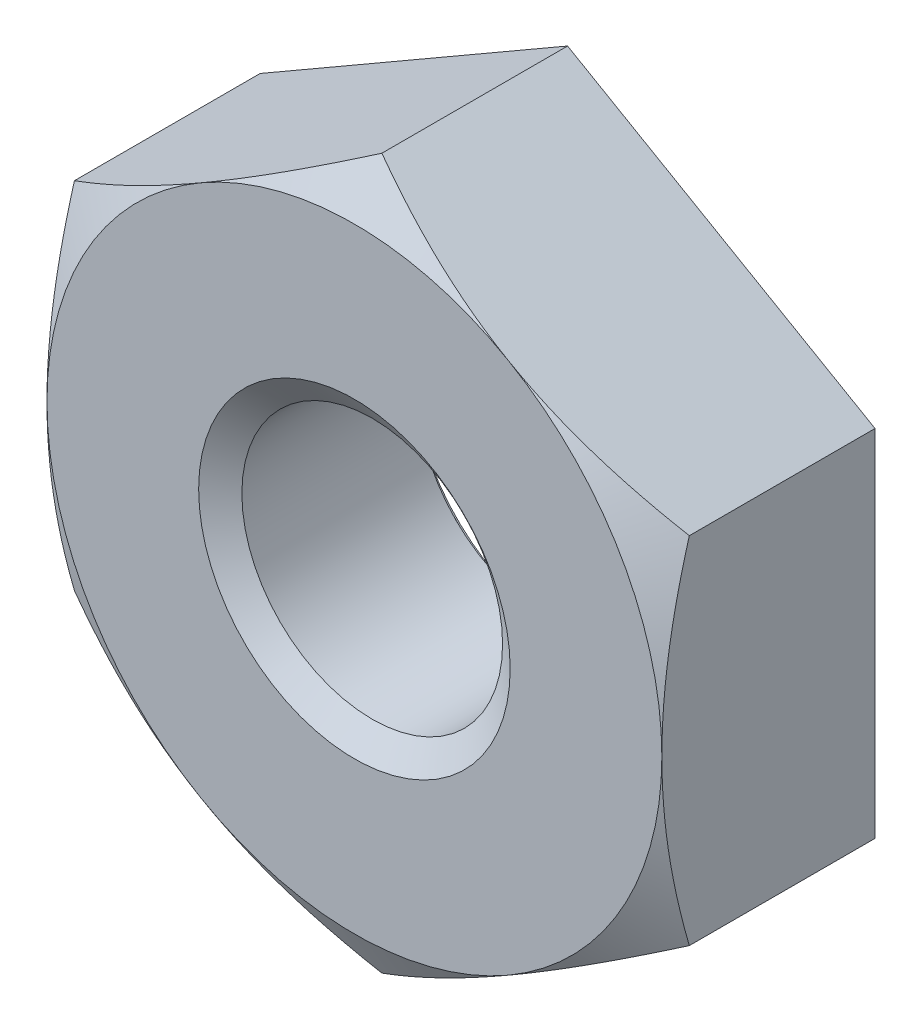
ISO-10303-21;
HEADER;
FILE_DESCRIPTION(('STEP AP214'),'2;1');
FILE_NAME('part.step','',(''),(''),'','','');
FILE_SCHEMA(('AUTOMOTIVE_DESIGN { 1 0 10303 214 1 1 1 1 }'));
ENDSEC;
DATA;
#1=APPLICATION_CONTEXT('core data for automotive mechanical design processes');
#2=APPLICATION_PROTOCOL_DEFINITION('international standard','automotive_design',2000,#1);
#3=PRODUCT_CONTEXT('',#1,'mechanical');
#4=PRODUCT('Part','Part','',(#3));
#5=PRODUCT_RELATED_PRODUCT_CATEGORY('part','',(#4));
#6=PRODUCT_DEFINITION_FORMATION('','',#4);
#7=PRODUCT_DEFINITION_CONTEXT('part definition',#1,'design');
#8=PRODUCT_DEFINITION('design','',#6,#7);
#9=PRODUCT_DEFINITION_SHAPE('','',#8);
#10=(LENGTH_UNIT() NAMED_UNIT(*) SI_UNIT(.MILLI.,.METRE.));
#11=(NAMED_UNIT(*) PLANE_ANGLE_UNIT() SI_UNIT($,.RADIAN.));
#12=(NAMED_UNIT(*) SI_UNIT($,.STERADIAN.) SOLID_ANGLE_UNIT());
#13=UNCERTAINTY_MEASURE_WITH_UNIT(LENGTH_MEASURE(1.E-05),#10,'distance_accuracy_value','');
#14=(GEOMETRIC_REPRESENTATION_CONTEXT(3) GLOBAL_UNCERTAINTY_ASSIGNED_CONTEXT((#13)) GLOBAL_UNIT_ASSIGNED_CONTEXT((#10,
#11,#12)) REPRESENTATION_CONTEXT('',''));
#15=CARTESIAN_POINT('',(0.,0.,0.));
#16=DIRECTION('',(0.,0.,1.));
#17=DIRECTION('',(1.,0.,0.));
#18=AXIS2_PLACEMENT_3D('',#15,#16,#17);
#19=CARTESIAN_POINT('',(0.,0.,-3.302));
#20=DIRECTION('',(0.,0.,1.));
#21=DIRECTION('',(1.,0.,0.));
#22=AXIS2_PLACEMENT_3D('',#19,#20,#21);
#23=CYLINDRICAL_SURFACE('',#22,2.0193);
#24=CARTESIAN_POINT('',(0.,0.,-0.275671707793163));
#25=DIRECTION('',(0.,0.,1.));
#26=DIRECTION('',(1.,0.,0.));
#27=AXIS2_PLACEMENT_3D('',#24,#25,#26);
#28=CIRCLE('',#27,2.0193);
#29=CARTESIAN_POINT('',(2.0193,0.,-0.275671707793163));
#30=VERTEX_POINT('',#29);
#31=EDGE_CURVE('E137',#30,#30,#28,.F.);
#32=ORIENTED_EDGE('',*,*,#31,.F.);
#33=EDGE_LOOP('',(#32));
#34=FACE_BOUND('',#33,.T.);
#35=CARTESIAN_POINT('',(0.,0.,-3.00092829220683));
#36=DIRECTION('',(0.,0.,-1.));
#37=DIRECTION('',(-1.,0.,0.));
#38=AXIS2_PLACEMENT_3D('',#35,#36,#37);
#39=CIRCLE('',#38,2.0193);
#40=CARTESIAN_POINT('',(-2.0193,0.,-3.00092829220683));
#41=VERTEX_POINT('',#40);
#42=EDGE_CURVE('E43',#41,#41,#39,.F.);
#43=ORIENTED_EDGE('',*,*,#42,.F.);
#44=EDGE_LOOP('',(#43));
#45=FACE_BOUND('',#44,.T.);
#46=ADVANCED_FACE('F38',(#34,#45),#23,.F.);
#47=CARTESIAN_POINT('',(0.,5.49926131403119,-3.302));
#48=DIRECTION('',(-0.500000000000002,0.866025403784437,0.));
#49=DIRECTION('',(-0.866025403784438,-0.500000000000002,0.));
#50=AXIS2_PLACEMENT_3D('',#47,#48,#49);
#51=PLANE('',#50);
#52=DIRECTION('',(0.,0.,1.));
#53=VECTOR('',#52,1.);
#54=CARTESIAN_POINT('',(-4.7625,2.74963065701559,-3.302));
#55=LINE('',#54,#53);
#56=CARTESIAN_POINT('',(-4.7625,2.74963065701559,-3.302));
#57=VERTEX_POINT('',#56);
#58=CARTESIAN_POINT('',(-4.7625,2.74963065701559,-0.425369342984413));
#59=VERTEX_POINT('',#58);
#60=EDGE_CURVE('E244',#57,#59,#55,.T.);
#61=ORIENTED_EDGE('',*,*,#60,.T.);
#62=CARTESIAN_POINT('',(-4.7627,2.74951518696175,-0.425436011750766));
#63=CARTESIAN_POINT('',(-4.55340263838612,2.8703530750302,-0.355653612413944));
#64=CARTESIAN_POINT('',(-4.34231515161877,2.99222449233789,-0.292183264615223));
#65=CARTESIAN_POINT('',(-3.91648500907589,3.23807763976408,-0.181395196068723));
#66=CARTESIAN_POINT('',(-3.701734787416,3.36206373804795,-0.134116665429795));
#67=CARTESIAN_POINT('',(-3.27486304406647,3.60851825398025,-0.0605335253687842));
#68=CARTESIAN_POINT('',(-3.06280800150459,3.73094828988637,-0.0337387922017265));
#69=CARTESIAN_POINT('',(-2.7439794939507,3.91502401454793,-0.00971112218087642));
#70=CARTESIAN_POINT('',(-2.63763059112772,3.9764245822208,-0.00439464100931322));
#71=CARTESIAN_POINT('',(-2.42483449751003,4.09928246415348,0.000759836568294737));
#72=CARTESIAN_POINT('',(-2.31838730985274,4.16073977660189,0.000598002190793362));
#73=CARTESIAN_POINT('',(-2.02675051194544,4.32911636037927,-0.00738494982191031));
#74=CARTESIAN_POINT('',(-1.84165753319303,4.43597984148709,-0.0207924204878943));
#75=CARTESIAN_POINT('',(-1.47270002105863,4.64899756043742,-0.0633078628436929));
#76=CARTESIAN_POINT('',(-1.28883678458933,4.75515104950705,-0.0924303682801025));
#77=CARTESIAN_POINT('',(-0.919135889202235,4.96859796097843,-0.165229253586903));
#78=CARTESIAN_POINT('',(-0.733344890273215,5.07586444422311,-0.209214113046657));
#79=CARTESIAN_POINT('',(-0.364533730991681,5.28879766631445,-0.30904227993883));
#80=CARTESIAN_POINT('',(-0.181508846544095,5.39446713261866,-0.364862134678061));
#81=CARTESIAN_POINT('',(0.000199999999996819,5.49937678408503,-0.425436011750772));
#82=B_SPLINE_CURVE_WITH_KNOTS('',3,(#62,#63,#64,#65,#66,#67,#68,#69,#70,#71,#72,#73,#74,#75,#76,
#77,#78,#79,#80,#81),.UNSPECIFIED.,.F.,.F.,(4,2,2,2,2,2,2,2,2,4),(0.,0.754910190012917,
1.51163483480638,2.24963134670895,2.61827336240839,2.9869039913527,3.6286742319225,
4.27103902109237,4.92765153591997,5.58297484368455),.UNSPECIFIED.);
#83=CARTESIAN_POINT('',(-2.38125000000001,4.12444598552338,0.));
#84=VERTEX_POINT('',#83);
#85=EDGE_CURVE('E62',#59,#84,#82,.T.);
#86=ORIENTED_EDGE('',*,*,#85,.T.);
#87=CARTESIAN_POINT('',(0.,5.49926131403119,-0.425369342984412));
#88=VERTEX_POINT('',#87);
#89=EDGE_CURVE('E150',#84,#88,#82,.T.);
#90=ORIENTED_EDGE('',*,*,#89,.T.);
#91=DIRECTION('',(0.,0.,1.));
#92=VECTOR('',#91,1.);
#93=CARTESIAN_POINT('',(0.,5.49926131403119,-3.302));
#94=LINE('',#93,#92);
#95=CARTESIAN_POINT('',(0.,5.49926131403119,-3.302));
#96=VERTEX_POINT('',#95);
#97=EDGE_CURVE('E243',#96,#88,#94,.T.);
#98=ORIENTED_EDGE('',*,*,#97,.F.);
#99=DIRECTION('',(-0.866025403784437,-0.500000000000002,0.));
#100=VECTOR('',#99,1.);
#101=CARTESIAN_POINT('',(0.,5.49926131403119,-3.302));
#102=LINE('',#101,#100);
#103=EDGE_CURVE('E271',#96,#57,#102,.T.);
#104=ORIENTED_EDGE('',*,*,#103,.T.);
#105=EDGE_LOOP('',(#61,#86,#90,#98,#104));
#106=FACE_BOUND('',#105,.T.);
#107=ADVANCED_FACE('F40',(#106),#51,.T.);
#108=CARTESIAN_POINT('',(4.7625,2.74963065701559,-3.302));
#109=DIRECTION('',(0.500000000000001,0.866025403784438,0.));
#110=DIRECTION('',(-0.866025403784438,0.500000000000001,0.));
#111=AXIS2_PLACEMENT_3D('',#108,#109,#110);
#112=PLANE('',#111);
#113=ORIENTED_EDGE('',*,*,#97,.T.);
#114=CARTESIAN_POINT('',(-0.000200000000002983,5.49937678408503,-0.425436011750773));
#115=CARTESIAN_POINT('',(0.209097361613876,5.37853889601658,-0.35565361241395));
#116=CARTESIAN_POINT('',(0.420184848381226,5.25666747870889,-0.292183264615228));
#117=CARTESIAN_POINT('',(0.846014990924112,5.01081433128269,-0.181395196068727));
#118=CARTESIAN_POINT('',(1.060765212584,4.88682823299883,-0.134116665429799));
#119=CARTESIAN_POINT('',(1.48763695593353,4.64037371706653,-0.060533525368787));
#120=CARTESIAN_POINT('',(1.69969199849541,4.51794368116041,-0.0337387922017288));
#121=CARTESIAN_POINT('',(2.0185205060493,4.33386795649885,-0.00971112218087808));
#122=CARTESIAN_POINT('',(2.12486940887228,4.27246738882597,-0.00439464100931467));
#123=CARTESIAN_POINT('',(2.33766550248998,4.1496095068933,0.000759836568293921));
#124=CARTESIAN_POINT('',(2.44411269014726,4.08815219444488,0.000598002190792994));
#125=CARTESIAN_POINT('',(2.73574948805456,3.9197756106675,-0.00738494982190966));
#126=CARTESIAN_POINT('',(2.92084246680697,3.81291212955969,-0.0207924204878932));
#127=CARTESIAN_POINT('',(3.28979997894137,3.59989441060936,-0.0633078628436906));
#128=CARTESIAN_POINT('',(3.47366321541067,3.49374092153973,-0.0924303682800995));
#129=CARTESIAN_POINT('',(3.84336411079777,3.28029401006835,-0.165229253586899));
#130=CARTESIAN_POINT('',(4.02915510972679,3.17302752682367,-0.209214113046653));
#131=CARTESIAN_POINT('',(4.39796626900832,2.96009430473233,-0.309042279938826));
#132=CARTESIAN_POINT('',(4.58099115345591,2.85442483842812,-0.364862134678056));
#133=CARTESIAN_POINT('',(4.7627,2.74951518696175,-0.425436011750767));
#134=B_SPLINE_CURVE_WITH_KNOTS('',3,(#114,#115,#116,#117,#118,#119,#120,#121,#122,#123,#124,
#125,#126,#127,#128,#129,#130,#131,#132,#133),.UNSPECIFIED.,.F.,.F.,(4,2,2,2,2,2,2,2,2,4),(0.,
0.754910190012919,1.51163483480638,2.24963134670895,2.6182733624084,2.9869039913527,
3.6286742319225,4.27103902109237,4.92765153591997,5.58297484368456),.UNSPECIFIED.);
#135=CARTESIAN_POINT('',(2.38125000000001,4.12444598552339,0.));
#136=VERTEX_POINT('',#135);
#137=EDGE_CURVE('E147',#88,#136,#134,.T.);
#138=ORIENTED_EDGE('',*,*,#137,.T.);
#139=CARTESIAN_POINT('',(4.7625,2.74963065701561,-0.425369342984412));
#140=VERTEX_POINT('',#139);
#141=EDGE_CURVE('E131',#136,#140,#134,.T.);
#142=ORIENTED_EDGE('',*,*,#141,.T.);
#143=DIRECTION('',(0.,0.,1.));
#144=VECTOR('',#143,1.);
#145=CARTESIAN_POINT('',(4.7625,2.74963065701559,-3.302));
#146=LINE('',#145,#144);
#147=CARTESIAN_POINT('',(4.7625,2.74963065701559,-3.302));
#148=VERTEX_POINT('',#147);
#149=EDGE_CURVE('E146',#148,#140,#146,.T.);
#150=ORIENTED_EDGE('',*,*,#149,.F.);
#151=DIRECTION('',(-0.866025403784438,0.500000000000001,0.));
#152=VECTOR('',#151,1.);
#153=CARTESIAN_POINT('',(4.7625,2.74963065701559,-3.302));
#154=LINE('',#153,#152);
#155=EDGE_CURVE('E248',#148,#96,#154,.T.);
#156=ORIENTED_EDGE('',*,*,#155,.T.);
#157=EDGE_LOOP('',(#113,#138,#142,#150,#156));
#158=FACE_BOUND('',#157,.T.);
#159=ADVANCED_FACE('F223',(#158),#112,.T.);
#160=CARTESIAN_POINT('',(4.7625,2.74963065701559,-3.302));
#161=DIRECTION('',(-1.,0.,0.));
#162=DIRECTION('',(0.,0.,1.));
#163=AXIS2_PLACEMENT_3D('',#160,#161,#162);
#164=PLANE('',#163);
#165=CARTESIAN_POINT('',(4.7625,-7.29242571304484,-2.27898343403964));
#166=CARTESIAN_POINT('',(4.7625,-7.08332503258644,-2.17793443460892));
#167=CARTESIAN_POINT('',(4.7625,-6.87372996761939,-2.07788994627172));
#168=CARTESIAN_POINT('',(4.7625,-6.45328375890255,-1.88038400304187));
#169=CARTESIAN_POINT('',(4.7625,-6.24243240531598,-1.78292299537275));
#170=CARTESIAN_POINT('',(4.7625,-5.818067307616,-1.59064459480452));
#171=CARTESIAN_POINT('',(4.7625,-5.60454523269944,-1.49584552190854));
#172=CARTESIAN_POINT('',(4.7625,-5.17574610716182,-1.31031922922938));
#173=CARTESIAN_POINT('',(4.7625,-4.96046914871243,-1.21959179719919));
#174=CARTESIAN_POINT('',(4.7625,-4.52514542755381,-1.04221436450315));
#175=CARTESIAN_POINT('',(4.7625,-4.30507255346547,-0.95562809667714));
#176=CARTESIAN_POINT('',(4.7625,-3.86233085885286,-0.789237026079924));
#177=CARTESIAN_POINT('',(4.7625,-3.6396617526365,-0.709432977795153));
#178=CARTESIAN_POINT('',(4.7625,-3.19183146915337,-0.558750437330524));
#179=CARTESIAN_POINT('',(4.7625,-2.96667674136296,-0.48785296946411));
#180=CARTESIAN_POINT('',(4.7625,-2.51316408606384,-0.357286935151367));
#181=CARTESIAN_POINT('',(4.7625,-2.28480719615869,-0.297614817726105));
#182=CARTESIAN_POINT('',(4.7625,-1.82474524250016,-0.192393335725107));
#183=CARTESIAN_POINT('',(4.7625,-1.59303930440612,-0.146847731515044));
#184=CARTESIAN_POINT('',(4.7625,-1.12680140245446,-0.0729572667243248));
#185=CARTESIAN_POINT('',(4.7625,-0.892269436098455,-0.044612421351301));
#186=CARTESIAN_POINT('',(4.7625,-0.540098243423067,-0.0168127698224282));
#187=CARTESIAN_POINT('',(4.7625,-0.423010288487483,-0.00999774479560475));
#188=CARTESIAN_POINT('',(4.7625,-0.188645495023612,-0.00132916739532877));
#189=CARTESIAN_POINT('',(4.7625,-0.0713686589680046,0.000524449409053692));
#190=CARTESIAN_POINT('',(4.7625,0.163123105354882,-0.000779595326748415));
#191=CARTESIAN_POINT('',(4.7625,0.28033804175227,-0.00393584200216169));
#192=CARTESIAN_POINT('',(4.7625,0.514533140154528,-0.0151795737408415));
#193=CARTESIAN_POINT('',(4.7625,0.631513289308019,-0.0232673217280245));
#194=CARTESIAN_POINT('',(4.7625,0.915050030184746,-0.0486788919016474));
#195=CARTESIAN_POINT('',(4.7625,1.08138937418057,-0.0684745311551024));
#196=CARTESIAN_POINT('',(4.7625,1.41276151801411,-0.116933997609659));
#197=CARTESIAN_POINT('',(4.7625,1.57779414061616,-0.145599007360521));
#198=CARTESIAN_POINT('',(4.7625,2.07083902042288,-0.243383100627564));
#199=CARTESIAN_POINT('',(4.7625,2.39654516294854,-0.324265654459843));
#200=CARTESIAN_POINT('',(4.7625,2.8839114252215,-0.463767781303889));
#201=CARTESIAN_POINT('',(4.7625,3.04811363656014,-0.514009375908404));
#202=CARTESIAN_POINT('',(4.7625,3.37480455011007,-0.619463864370049));
#203=CARTESIAN_POINT('',(4.7625,3.53729434901435,-0.674673329356529));
#204=CARTESIAN_POINT('',(4.7625,3.85988055284393,-0.788914900372853));
#205=CARTESIAN_POINT('',(4.7625,4.01998528140537,-0.847923740867383));
#206=CARTESIAN_POINT('',(4.7625,4.33895253974559,-0.969404920092007));
#207=CARTESIAN_POINT('',(4.7625,4.4978145374447,-1.03187865865025));
#208=CARTESIAN_POINT('',(4.7625,4.6561021660602,-1.09574291091382));
#209=B_SPLINE_CURVE_WITH_KNOTS('',3,(#165,#166,#167,#168,#169,#170,#171,#172,#173,#174,#175,
#176,#177,#178,#179,#180,#181,#182,#183,#184,#185,#186,#187,#188,#189,#190,#191,#192,#193,#194,
#195,#196,#197,#198,#199,#200,#201,#202,#203,#204,#205,#206,#207,#208),.UNSPECIFIED.,.F.,.F.,(4,
2,2,2,2,2,2,2,2,2,2,2,2,2,2,2,2,2,2,2,2,4),(0.,0.696720165483735,1.39356016205725,
2.09438789250382,2.79517904757872,3.50457374312629,4.21404725210227,4.92198260780581,
5.6296936403172,6.33759289852653,7.04549278260686,7.39726182154395,7.74902629223847,
8.10069143675107,8.45237533199633,8.95462912158064,9.45694990534677,10.4623513294482,
10.9774608355396,11.4922174961111,12.0040767603637,12.5161443452105),.UNSPECIFIED.);
#210=CARTESIAN_POINT('',(4.76250000000001,-2.7496306570156,-0.425369342984412));
#211=VERTEX_POINT('',#210);
#212=CARTESIAN_POINT('',(4.7625,0.,0.));
#213=VERTEX_POINT('',#212);
#214=EDGE_CURVE('E112',#211,#213,#209,.T.);
#215=ORIENTED_EDGE('',*,*,#214,.F.);
#216=DIRECTION('',(0.,0.,1.));
#217=VECTOR('',#216,1.);
#218=CARTESIAN_POINT('',(4.7625,-2.7496306570156,-3.302));
#219=LINE('',#218,#217);
#220=CARTESIAN_POINT('',(4.7625,-2.7496306570156,-3.302));
#221=VERTEX_POINT('',#220);
#222=EDGE_CURVE('E253',#221,#211,#219,.T.);
#223=ORIENTED_EDGE('',*,*,#222,.F.);
#224=DIRECTION('',(0.,-1.,0.));
#225=VECTOR('',#224,1.);
#226=CARTESIAN_POINT('',(4.7625,2.74963065701559,-3.302));
#227=LINE('',#226,#225);
#228=EDGE_CURVE('E260',#148,#221,#227,.T.);
#229=ORIENTED_EDGE('',*,*,#228,.F.);
#230=ORIENTED_EDGE('',*,*,#149,.T.);
#231=EDGE_CURVE('E125',#213,#140,#209,.T.);
#232=ORIENTED_EDGE('',*,*,#231,.F.);
#233=EDGE_LOOP('',(#215,#223,#229,#230,#232));
#234=FACE_BOUND('',#233,.T.);
#235=ADVANCED_FACE('F144',(#234),#164,.F.);
#236=CARTESIAN_POINT('',(0.,-5.49926131403121,-3.302));
#237=DIRECTION('',(0.500000000000002,-0.866025403784438,0.));
#238=DIRECTION('',(0.866025403784438,0.500000000000002,0.));
#239=AXIS2_PLACEMENT_3D('',#236,#237,#238);
#240=PLANE('',#239);
#241=ORIENTED_EDGE('',*,*,#222,.T.);
#242=CARTESIAN_POINT('',(4.7627,-2.74951518696176,-0.42543601175077));
#243=CARTESIAN_POINT('',(4.55340263838612,-2.87035307503021,-0.355653612413947));
#244=CARTESIAN_POINT('',(4.34231515161877,-2.99222449233791,-0.292183264615227));
#245=CARTESIAN_POINT('',(3.91648500907588,-3.2380776397641,-0.181395196068727));
#246=CARTESIAN_POINT('',(3.70173478741599,-3.36206373804797,-0.1341166654298));
#247=CARTESIAN_POINT('',(3.27486304406647,-3.60851825398026,-0.0605335253687901));
#248=CARTESIAN_POINT('',(3.06280800150458,-3.73094828988639,-0.0337387922017326));
#249=CARTESIAN_POINT('',(2.7439794939507,-3.91502401454795,-0.00971112218088317));
#250=CARTESIAN_POINT('',(2.63763059112771,-3.97642458222082,-0.00439464100932027));
#251=CARTESIAN_POINT('',(2.42483449751002,-4.0992824641535,0.000759836568287514));
#252=CARTESIAN_POINT('',(2.31838730985274,-4.16073977660191,0.000598002190786272));
#253=CARTESIAN_POINT('',(2.02675051194544,-4.32911636037929,-0.00738494982191751));
#254=CARTESIAN_POINT('',(1.84165753319303,-4.4359798414871,-0.020792420487902));
#255=CARTESIAN_POINT('',(1.47270002105863,-4.64899756043744,-0.063307862843701));
#256=CARTESIAN_POINT('',(1.28883678458933,-4.75515104950706,-0.0924303682801104));
#257=CARTESIAN_POINT('',(0.919135889202231,-4.96859796097845,-0.16522925358691));
#258=CARTESIAN_POINT('',(0.733344890273212,-5.07586444422313,-0.209214113046665));
#259=CARTESIAN_POINT('',(0.364533730991678,-5.28879766631446,-0.309042279938839));
#260=CARTESIAN_POINT('',(0.181508846544091,-5.39446713261868,-0.364862134678069));
#261=CARTESIAN_POINT('',(-0.000199999999999972,-5.49937678408504,-0.42543601175078));
#262=B_SPLINE_CURVE_WITH_KNOTS('',3,(#242,#243,#244,#245,#246,#247,#248,#249,#250,#251,#252,
#253,#254,#255,#256,#257,#258,#259,#260,#261),.UNSPECIFIED.,.F.,.F.,(4,2,2,2,2,2,2,2,2,4),(0.,
0.754910190012917,1.51163483480638,2.24963134670895,2.61827336240839,2.9869039913527,
3.6286742319225,4.27103902109237,4.92765153591997,5.58297484368455),.UNSPECIFIED.);
#263=CARTESIAN_POINT('',(2.38125000000001,-4.12444598552339,0.));
#264=VERTEX_POINT('',#263);
#265=EDGE_CURVE('E119',#211,#264,#262,.T.);
#266=ORIENTED_EDGE('',*,*,#265,.T.);
#267=CARTESIAN_POINT('',(0.,-5.49926131403119,-0.425369342984412));
#268=VERTEX_POINT('',#267);
#269=EDGE_CURVE('E158',#264,#268,#262,.T.);
#270=ORIENTED_EDGE('',*,*,#269,.T.);
#271=DIRECTION('',(0.,0.,1.));
#272=VECTOR('',#271,1.);
#273=CARTESIAN_POINT('',(0.,-5.49926131403121,-3.302));
#274=LINE('',#273,#272);
#275=CARTESIAN_POINT('',(0.,-5.49926131403121,-3.302));
#276=VERTEX_POINT('',#275);
#277=EDGE_CURVE('E250',#276,#268,#274,.T.);
#278=ORIENTED_EDGE('',*,*,#277,.F.);
#279=DIRECTION('',(0.866025403784438,0.500000000000002,0.));
#280=VECTOR('',#279,1.);
#281=CARTESIAN_POINT('',(0.,-5.49926131403121,-3.302));
#282=LINE('',#281,#280);
#283=EDGE_CURVE('E262',#276,#221,#282,.T.);
#284=ORIENTED_EDGE('',*,*,#283,.T.);
#285=EDGE_LOOP('',(#241,#266,#270,#278,#284));
#286=FACE_BOUND('',#285,.T.);
#287=ADVANCED_FACE('F204',(#286),#240,.T.);
#288=CARTESIAN_POINT('',(-4.7625,-2.7496306570156,-3.302));
#289=DIRECTION('',(-0.500000000000001,-0.866025403784438,0.));
#290=DIRECTION('',(0.866025403784438,-0.500000000000001,0.));
#291=AXIS2_PLACEMENT_3D('',#288,#289,#290);
#292=PLANE('',#291);
#293=ORIENTED_EDGE('',*,*,#277,.T.);
#294=CARTESIAN_POINT('',(0.00020000000000037,-5.49937678408504,-0.42543601175078));
#295=CARTESIAN_POINT('',(-0.209097361613879,-5.37853889601659,-0.355653612413957));
#296=CARTESIAN_POINT('',(-0.42018484838123,-5.2566674787089,-0.292183264615236));
#297=CARTESIAN_POINT('',(-0.846014990924117,-5.01081433128271,-0.181395196068734));
#298=CARTESIAN_POINT('',(-1.06076521258401,-4.88682823299884,-0.134116665429806));
#299=CARTESIAN_POINT('',(-1.48763695593353,-4.64037371706654,-0.0605335253687945));
#300=CARTESIAN_POINT('',(-1.69969199849542,-4.51794368116042,-0.0337387922017366));
#301=CARTESIAN_POINT('',(-2.01852050604931,-4.33386795649886,-0.00971112218088568));
#302=CARTESIAN_POINT('',(-2.12486940887229,-4.27246738882598,-0.00439464100932212));
#303=CARTESIAN_POINT('',(-2.33766550248999,-4.14960950689331,0.000759836568286355));
#304=CARTESIAN_POINT('',(-2.44411269014727,-4.08815219444489,0.000598002190785165));
#305=CARTESIAN_POINT('',(-2.73574948805457,-3.91977561066752,-0.00738494982191796));
#306=CARTESIAN_POINT('',(-2.92084246680698,-3.8129121295597,-0.0207924204879014));
#307=CARTESIAN_POINT('',(-3.28979997894138,-3.59989441060937,-0.0633078628436988));
#308=CARTESIAN_POINT('',(-3.47366321541067,-3.49374092153975,-0.0924303682801078));
#309=CARTESIAN_POINT('',(-3.84336411079777,-3.28029401006836,-0.165229253586906));
#310=CARTESIAN_POINT('',(-4.02915510972679,-3.17302752682368,-0.20921411304666));
#311=CARTESIAN_POINT('',(-4.39796626900832,-2.96009430473235,-0.309042279938832));
#312=CARTESIAN_POINT('',(-4.58099115345591,-2.85442483842813,-0.364862134678061));
#313=CARTESIAN_POINT('',(-4.7627,-2.74951518696177,-0.425436011750772));
#314=B_SPLINE_CURVE_WITH_KNOTS('',3,(#294,#295,#296,#297,#298,#299,#300,#301,#302,#303,#304,
#305,#306,#307,#308,#309,#310,#311,#312,#313),.UNSPECIFIED.,.F.,.F.,(4,2,2,2,2,2,2,2,2,4),(0.,
0.754910190012921,1.51163483480639,2.24963134670896,2.6182733624084,2.98690399135271,
3.62867423192251,4.27103902109237,4.92765153591997,5.58297484368455),.UNSPECIFIED.);
#315=CARTESIAN_POINT('',(-2.38125000000001,-4.12444598552339,0.));
#316=VERTEX_POINT('',#315);
#317=EDGE_CURVE('E198',#268,#316,#314,.T.);
#318=ORIENTED_EDGE('',*,*,#317,.T.);
#319=CARTESIAN_POINT('',(-4.7625,-2.7496306570156,-0.425369342984412));
#320=VERTEX_POINT('',#319);
#321=EDGE_CURVE('E190',#316,#320,#314,.T.);
#322=ORIENTED_EDGE('',*,*,#321,.T.);
#323=DIRECTION('',(0.,0.,1.));
#324=VECTOR('',#323,1.);
#325=CARTESIAN_POINT('',(-4.7625,-2.7496306570156,-3.302));
#326=LINE('',#325,#324);
#327=CARTESIAN_POINT('',(-4.7625,-2.7496306570156,-3.302));
#328=VERTEX_POINT('',#327);
#329=EDGE_CURVE('E247',#328,#320,#326,.T.);
#330=ORIENTED_EDGE('',*,*,#329,.F.);
#331=DIRECTION('',(0.866025403784438,-0.500000000000001,0.));
#332=VECTOR('',#331,1.);
#333=CARTESIAN_POINT('',(-4.7625,-2.7496306570156,-3.302));
#334=LINE('',#333,#332);
#335=EDGE_CURVE('E265',#328,#276,#334,.T.);
#336=ORIENTED_EDGE('',*,*,#335,.T.);
#337=EDGE_LOOP('',(#293,#318,#322,#330,#336));
#338=FACE_BOUND('',#337,.T.);
#339=ADVANCED_FACE('F200',(#338),#292,.T.);
#340=CARTESIAN_POINT('',(-4.7625,2.74963065701559,-3.302));
#341=DIRECTION('',(-1.,0.,0.));
#342=DIRECTION('',(0.,0.,1.));
#343=AXIS2_PLACEMENT_3D('',#340,#341,#342);
#344=PLANE('',#343);
#345=ORIENTED_EDGE('',*,*,#329,.T.);
#346=CARTESIAN_POINT('',(-4.7625,-7.29242571304485,-2.27898343403965));
#347=CARTESIAN_POINT('',(-4.7625,-7.08332503258645,-2.17793443460893));
#348=CARTESIAN_POINT('',(-4.7625,-6.8737299676194,-2.07788994627172));
#349=CARTESIAN_POINT('',(-4.7625,-6.45328375890255,-1.88038400304188));
#350=CARTESIAN_POINT('',(-4.7625,-6.24243240531599,-1.78292299537276));
#351=CARTESIAN_POINT('',(-4.7625,-5.81806730761601,-1.59064459480452));
#352=CARTESIAN_POINT('',(-4.7625,-5.60454523269944,-1.49584552190855));
#353=CARTESIAN_POINT('',(-4.7625,-5.17574610716182,-1.31031922922938));
#354=CARTESIAN_POINT('',(-4.7625,-4.96046914871244,-1.21959179719919));
#355=CARTESIAN_POINT('',(-4.7625,-4.52514542755381,-1.04221436450316));
#356=CARTESIAN_POINT('',(-4.7625,-4.30507255346547,-0.955628096677142));
#357=CARTESIAN_POINT('',(-4.7625,-3.86233085885287,-0.789237026079925));
#358=CARTESIAN_POINT('',(-4.7625,-3.63966175263651,-0.709432977795155));
#359=CARTESIAN_POINT('',(-4.7625,-3.19183146915337,-0.558750437330527));
#360=CARTESIAN_POINT('',(-4.7625,-2.96667674136296,-0.487852969464112));
#361=CARTESIAN_POINT('',(-4.7625,-2.51316408606384,-0.357286935151368));
#362=CARTESIAN_POINT('',(-4.7625,-2.28480719615869,-0.297614817726107));
#363=CARTESIAN_POINT('',(-4.7625,-1.82474524250016,-0.192393335725108));
#364=CARTESIAN_POINT('',(-4.7625,-1.59303930440613,-0.146847731515046));
#365=CARTESIAN_POINT('',(-4.7625,-1.12680140245446,-0.0729572667243261));
#366=CARTESIAN_POINT('',(-4.7625,-0.892269436098457,-0.0446124213513021));
#367=CARTESIAN_POINT('',(-4.7625,-0.540098243423068,-0.0168127698224292));
#368=CARTESIAN_POINT('',(-4.7625,-0.423010288487485,-0.00999774479560574));
#369=CARTESIAN_POINT('',(-4.7625,-0.188645495023614,-0.00132916739532978));
#370=CARTESIAN_POINT('',(-4.7625,-0.0713686589680062,0.000524449409052686));
#371=CARTESIAN_POINT('',(-4.7625,0.163123105354881,-0.000779595326749411));
#372=CARTESIAN_POINT('',(-4.7625,0.280338041752268,-0.00393584200216268));
#373=CARTESIAN_POINT('',(-4.7625,0.514533140154526,-0.0151795737408425));
#374=CARTESIAN_POINT('',(-4.7625,0.631513289308017,-0.0232673217280256));
#375=CARTESIAN_POINT('',(-4.7625,0.915050030184744,-0.0486788919016483));
#376=CARTESIAN_POINT('',(-4.7625,1.08138937418056,-0.068474531155103));
#377=CARTESIAN_POINT('',(-4.7625,1.41276151801411,-0.116933997609659));
#378=CARTESIAN_POINT('',(-4.7625,1.57779414061616,-0.145599007360522));
#379=CARTESIAN_POINT('',(-4.7625,2.07083902042288,-0.243383100627565));
#380=CARTESIAN_POINT('',(-4.7625,2.39654516294853,-0.324265654459844));
#381=CARTESIAN_POINT('',(-4.7625,2.8839114252215,-0.46376778130389));
#382=CARTESIAN_POINT('',(-4.7625,3.04811363656014,-0.514009375908405));
#383=CARTESIAN_POINT('',(-4.7625,3.37480455011007,-0.61946386437005));
#384=CARTESIAN_POINT('',(-4.7625,3.53729434901435,-0.674673329356529));
#385=CARTESIAN_POINT('',(-4.7625,3.85988055284393,-0.788914900372853));
#386=CARTESIAN_POINT('',(-4.7625,4.01998528140537,-0.847923740867384));
#387=CARTESIAN_POINT('',(-4.7625,4.33895253974559,-0.969404920092007));
#388=CARTESIAN_POINT('',(-4.7625,4.4978145374447,-1.03187865865025));
#389=CARTESIAN_POINT('',(-4.7625,4.65610216606019,-1.09574291091382));
#390=B_SPLINE_CURVE_WITH_KNOTS('',3,(#346,#347,#348,#349,#350,#351,#352,#353,#354,#355,#356,
#357,#358,#359,#360,#361,#362,#363,#364,#365,#366,#367,#368,#369,#370,#371,#372,#373,#374,#375,
#376,#377,#378,#379,#380,#381,#382,#383,#384,#385,#386,#387,#388,#389),.UNSPECIFIED.,.F.,.F.,(4,
2,2,2,2,2,2,2,2,2,2,2,2,2,2,2,2,2,2,2,2,4),(0.,0.696720165483736,1.39356016205726,
2.09438789250382,2.79517904757873,3.50457374312629,4.21404725210227,4.92198260780581,
5.62969364031721,6.33759289852654,7.04549278260687,7.39726182154396,7.74902629223848,
8.10069143675108,8.45237533199634,8.95462912158065,9.45694990534678,10.4623513294482,
10.9774608355396,11.4922174961111,12.0040767603637,12.5161443452105),.UNSPECIFIED.);
#391=CARTESIAN_POINT('',(-4.7625,0.,0.));
#392=VERTEX_POINT('',#391);
#393=EDGE_CURVE('E199',#320,#392,#390,.T.);
#394=ORIENTED_EDGE('',*,*,#393,.T.);
#395=EDGE_CURVE('E136',#392,#59,#390,.T.);
#396=ORIENTED_EDGE('',*,*,#395,.T.);
#397=ORIENTED_EDGE('',*,*,#60,.F.);
#398=DIRECTION('',(0.,-1.,0.));
#399=VECTOR('',#398,1.);
#400=CARTESIAN_POINT('',(-4.7625,2.74963065701559,-3.302));
#401=LINE('',#400,#399);
#402=EDGE_CURVE('E268',#57,#328,#401,.T.);
#403=ORIENTED_EDGE('',*,*,#402,.T.);
#404=EDGE_LOOP('',(#345,#394,#396,#397,#403));
#405=FACE_BOUND('',#404,.T.);
#406=ADVANCED_FACE('F203',(#405),#344,.T.);
#407=CARTESIAN_POINT('',(0.,5.49926131403119,0.));
#408=DIRECTION('',(0.,0.,-1.));
#409=DIRECTION('',(-1.,0.,0.));
#410=AXIS2_PLACEMENT_3D('',#407,#408,#409);
#411=PLANE('',#410);
#412=CARTESIAN_POINT('',(0.,0.,0.));
#413=DIRECTION('',(0.,0.,1.));
#414=DIRECTION('',(1.,0.,0.));
#415=AXIS2_PLACEMENT_3D('',#412,#413,#414);
#416=CIRCLE('',#415,2.413);
#417=CARTESIAN_POINT('',(2.413,0.,0.));
#418=VERTEX_POINT('',#417);
#419=EDGE_CURVE('E231',#418,#418,#416,.T.);
#420=ORIENTED_EDGE('',*,*,#419,.F.);
#421=EDGE_LOOP('',(#420));
#422=FACE_BOUND('',#421,.T.);
#423=CARTESIAN_POINT('',(0.,0.,0.));
#424=DIRECTION('',(0.,0.,-1.));
#425=DIRECTION('',(-1.,0.,0.));
#426=AXIS2_PLACEMENT_3D('',#423,#424,#425);
#427=CIRCLE('',#426,4.7625);
#428=EDGE_CURVE('E50',#84,#392,#427,.F.);
#429=ORIENTED_EDGE('',*,*,#428,.T.);
#430=EDGE_CURVE('E11',#392,#316,#427,.F.);
#431=ORIENTED_EDGE('',*,*,#430,.T.);
#432=EDGE_CURVE('E48',#316,#264,#427,.F.);
#433=ORIENTED_EDGE('',*,*,#432,.T.);
#434=EDGE_CURVE('E116',#264,#213,#427,.F.);
#435=ORIENTED_EDGE('',*,*,#434,.T.);
#436=CARTESIAN_POINT('',(0.,0.,0.));
#437=DIRECTION('',(0.,0.,1.));
#438=DIRECTION('',(1.,0.,0.));
#439=AXIS2_PLACEMENT_3D('',#436,#437,#438);
#440=CIRCLE('',#439,4.7625);
#441=EDGE_CURVE('E128',#213,#136,#440,.T.);
#442=ORIENTED_EDGE('',*,*,#441,.T.);
#443=EDGE_CURVE('E142',#136,#84,#427,.F.);
#444=ORIENTED_EDGE('',*,*,#443,.T.);
#445=EDGE_LOOP('',(#429,#431,#433,#435,#442,#444));
#446=FACE_BOUND('',#445,.T.);
#447=ADVANCED_FACE('F140',(#422,#446),#411,.F.);
#448=CARTESIAN_POINT('',(0.,5.49926131403119,-3.302));
#449=DIRECTION('',(0.,0.,-1.));
#450=DIRECTION('',(-1.,0.,0.));
#451=AXIS2_PLACEMENT_3D('',#448,#449,#450);
#452=PLANE('',#451);
#453=CARTESIAN_POINT('',(0.,0.,-3.302));
#454=DIRECTION('',(0.,0.,-1.));
#455=DIRECTION('',(-1.,0.,0.));
#456=AXIS2_PLACEMENT_3D('',#453,#454,#455);
#457=CIRCLE('',#456,2.413);
#458=CARTESIAN_POINT('',(-2.413,0.,-3.302));
#459=VERTEX_POINT('',#458);
#460=EDGE_CURVE('E232',#459,#459,#457,.F.);
#461=ORIENTED_EDGE('',*,*,#460,.T.);
#462=EDGE_LOOP('',(#461));
#463=FACE_BOUND('',#462,.T.);
#464=ORIENTED_EDGE('',*,*,#103,.F.);
#465=ORIENTED_EDGE('',*,*,#155,.F.);
#466=ORIENTED_EDGE('',*,*,#228,.T.);
#467=ORIENTED_EDGE('',*,*,#283,.F.);
#468=ORIENTED_EDGE('',*,*,#335,.F.);
#469=ORIENTED_EDGE('',*,*,#402,.F.);
#470=EDGE_LOOP('',(#464,#465,#466,#467,#468,#469));
#471=FACE_BOUND('',#470,.T.);
#472=ADVANCED_FACE('F214',(#463,#471),#452,.T.);
#473=CARTESIAN_POINT('',(0.,0.,0.));
#474=DIRECTION('',(0.,0.,-1.));
#475=DIRECTION('',(-1.,0.,0.));
#476=AXIS2_PLACEMENT_3D('',#473,#474,#475);
#477=CONICAL_SURFACE('',#476,4.7625,1.0471975511966);
#478=ORIENTED_EDGE('',*,*,#395,.F.);
#479=ORIENTED_EDGE('',*,*,#428,.F.);
#480=ORIENTED_EDGE('',*,*,#85,.F.);
#481=EDGE_LOOP('',(#478,#479,#480));
#482=FACE_BOUND('',#481,.T.);
#483=ADVANCED_FACE('F281',(#482),#477,.T.);
#484=ORIENTED_EDGE('',*,*,#443,.F.);
#485=ORIENTED_EDGE('',*,*,#137,.F.);
#486=ORIENTED_EDGE('',*,*,#89,.F.);
#487=EDGE_LOOP('',(#484,#485,#486));
#488=FACE_BOUND('',#487,.T.);
#489=ADVANCED_FACE('F178',(#488),#477,.T.);
#490=ORIENTED_EDGE('',*,*,#441,.F.);
#491=ORIENTED_EDGE('',*,*,#231,.T.);
#492=ORIENTED_EDGE('',*,*,#141,.F.);
#493=EDGE_LOOP('',(#490,#491,#492));
#494=FACE_BOUND('',#493,.T.);
#495=ADVANCED_FACE('F129',(#494),#477,.T.);
#496=ORIENTED_EDGE('',*,*,#214,.T.);
#497=ORIENTED_EDGE('',*,*,#434,.F.);
#498=ORIENTED_EDGE('',*,*,#265,.F.);
#499=EDGE_LOOP('',(#496,#497,#498));
#500=FACE_BOUND('',#499,.T.);
#501=ADVANCED_FACE('F114',(#500),#477,.T.);
#502=ORIENTED_EDGE('',*,*,#432,.F.);
#503=ORIENTED_EDGE('',*,*,#317,.F.);
#504=ORIENTED_EDGE('',*,*,#269,.F.);
#505=EDGE_LOOP('',(#502,#503,#504));
#506=FACE_BOUND('',#505,.T.);
#507=ADVANCED_FACE('F177',(#506),#477,.T.);
#508=ORIENTED_EDGE('',*,*,#430,.F.);
#509=ORIENTED_EDGE('',*,*,#393,.F.);
#510=ORIENTED_EDGE('',*,*,#321,.F.);
#511=EDGE_LOOP('',(#508,#509,#510));
#512=FACE_BOUND('',#511,.T.);
#513=ADVANCED_FACE('F171',(#512),#477,.T.);
#514=CARTESIAN_POINT('',(0.,0.,-0.303238878572479));
#515=DIRECTION('',(0.,0.,1.));
#516=DIRECTION('',(1.,0.,0.));
#517=AXIS2_PLACEMENT_3D('',#514,#515,#516);
#518=CONICAL_SURFACE('',#517,1.97993,0.95993108859688);
#519=ORIENTED_EDGE('',*,*,#419,.T.);
#520=EDGE_LOOP('',(#519));
#521=FACE_BOUND('',#520,.T.);
#522=ORIENTED_EDGE('',*,*,#31,.T.);
#523=EDGE_LOOP('',(#522));
#524=FACE_BOUND('',#523,.T.);
#525=ADVANCED_FACE('F176',(#521,#524),#518,.F.);
#526=CARTESIAN_POINT('',(0.,0.,-3.2766));
#527=DIRECTION('',(0.,0.,-1.));
#528=DIRECTION('',(-1.,0.,0.));
#529=AXIS2_PLACEMENT_3D('',#526,#527,#528);
#530=CONICAL_SURFACE('',#529,2.413,0.959931088596881);
#531=CARTESIAN_POINT('',(0.,0.,-3.2766));
#532=DIRECTION('',(0.,0.,1.));
#533=DIRECTION('',(1.,0.,0.));
#534=AXIS2_PLACEMENT_3D('',#531,#532,#533);
#535=CIRCLE('',#534,2.413);
#536=CARTESIAN_POINT('',(2.413,0.,-3.2766));
#537=VERTEX_POINT('',#536);
#538=EDGE_CURVE('E236',#537,#537,#535,.T.);
#539=ORIENTED_EDGE('',*,*,#538,.F.);
#540=EDGE_LOOP('',(#539));
#541=FACE_BOUND('',#540,.T.);
#542=ORIENTED_EDGE('',*,*,#42,.T.);
#543=EDGE_LOOP('',(#542));
#544=FACE_BOUND('',#543,.T.);
#545=ADVANCED_FACE('F367',(#541,#544),#530,.F.);
#546=CARTESIAN_POINT('',(0.,0.,-25.0375057290932));
#547=DIRECTION('',(0.,0.,1.));
#548=DIRECTION('',(1.,0.,0.));
#549=AXIS2_PLACEMENT_3D('',#546,#547,#548);
#550=CYLINDRICAL_SURFACE('',#549,2.413);
#551=ORIENTED_EDGE('',*,*,#460,.F.);
#552=EDGE_LOOP('',(#551));
#553=FACE_BOUND('',#552,.T.);
#554=ORIENTED_EDGE('',*,*,#538,.T.);
#555=EDGE_LOOP('',(#554));
#556=FACE_BOUND('',#555,.T.);
#557=ADVANCED_FACE('F376',(#553,#556),#550,.F.);
#558=CLOSED_SHELL('',(#46,#107,#159,#235,#287,#339,#406,#447,#472,#483,#489,#495,#501,#507,#513,
#525,#545,#557));
#559=MANIFOLD_SOLID_BREP('B2',#558);
#560=ADVANCED_BREP_SHAPE_REPRESENTATION('',(#18,#559),#14);
#561=SHAPE_DEFINITION_REPRESENTATION(#9,#560);
ENDSEC;
END-ISO-10303-21;
